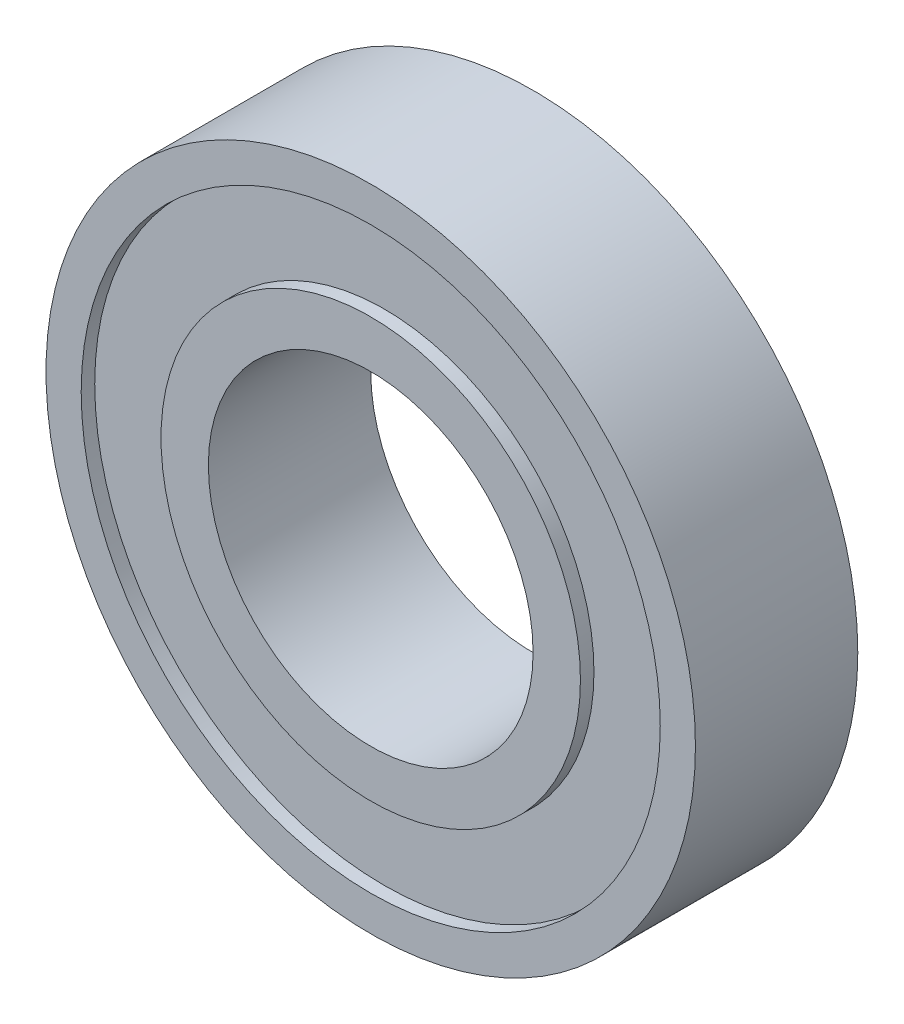
ISO-10303-21;
HEADER;
FILE_DESCRIPTION(('STEP AP214'),'2;1');
FILE_NAME('part.step','',(''),(''),'','','');
FILE_SCHEMA(('AUTOMOTIVE_DESIGN { 1 0 10303 214 1 1 1 1 }'));
ENDSEC;
DATA;
#1=APPLICATION_CONTEXT('core data for automotive mechanical design processes');
#2=APPLICATION_PROTOCOL_DEFINITION('international standard','automotive_design',2000,#1);
#3=PRODUCT_CONTEXT('',#1,'mechanical');
#4=PRODUCT('Part','Part','',(#3));
#5=PRODUCT_RELATED_PRODUCT_CATEGORY('part','',(#4));
#6=PRODUCT_DEFINITION_FORMATION('','',#4);
#7=PRODUCT_DEFINITION_CONTEXT('part definition',#1,'design');
#8=PRODUCT_DEFINITION('design','',#6,#7);
#9=PRODUCT_DEFINITION_SHAPE('','',#8);
#10=(LENGTH_UNIT() NAMED_UNIT(*) SI_UNIT(.MILLI.,.METRE.));
#11=(NAMED_UNIT(*) PLANE_ANGLE_UNIT() SI_UNIT($,.RADIAN.));
#12=(NAMED_UNIT(*) SI_UNIT($,.STERADIAN.) SOLID_ANGLE_UNIT());
#13=UNCERTAINTY_MEASURE_WITH_UNIT(LENGTH_MEASURE(1.E-05),#10,'distance_accuracy_value','');
#14=(GEOMETRIC_REPRESENTATION_CONTEXT(3) GLOBAL_UNCERTAINTY_ASSIGNED_CONTEXT((#13)) GLOBAL_UNIT_ASSIGNED_CONTEXT((#10,
#11,#12)) REPRESENTATION_CONTEXT('',''));
#15=CARTESIAN_POINT('',(0.,0.,0.));
#16=DIRECTION('',(0.,0.,1.));
#17=DIRECTION('',(1.,0.,0.));
#18=AXIS2_PLACEMENT_3D('',#15,#16,#17);
#19=CARTESIAN_POINT('',(0.,0.,-3.));
#20=DIRECTION('',(0.,0.,1.));
#21=DIRECTION('',(1.,0.,0.));
#22=AXIS2_PLACEMENT_3D('',#19,#20,#21);
#23=PLANE('',#22);
#24=CARTESIAN_POINT('',(0.,0.,-3.));
#25=DIRECTION('',(0.,0.,1.));
#26=DIRECTION('',(1.,0.,0.));
#27=AXIS2_PLACEMENT_3D('',#24,#25,#26);
#28=CIRCLE('',#27,6.);
#29=CARTESIAN_POINT('',(6.,0.,-3.));
#30=VERTEX_POINT('',#29);
#31=EDGE_CURVE('E41',#30,#30,#28,.T.);
#32=ORIENTED_EDGE('',*,*,#31,.T.);
#33=EDGE_LOOP('',(#32));
#34=FACE_BOUND('',#33,.T.);
#35=CARTESIAN_POINT('',(0.,0.,-3.));
#36=DIRECTION('',(0.,0.,1.));
#37=DIRECTION('',(1.,0.,0.));
#38=AXIS2_PLACEMENT_3D('',#35,#36,#37);
#39=CIRCLE('',#38,7.75);
#40=CARTESIAN_POINT('',(7.75,0.,-3.));
#41=VERTEX_POINT('',#40);
#42=EDGE_CURVE('E67',#41,#41,#39,.T.);
#43=ORIENTED_EDGE('',*,*,#42,.F.);
#44=EDGE_LOOP('',(#43));
#45=FACE_BOUND('',#44,.T.);
#46=ADVANCED_FACE('F30',(#34,#45),#23,.F.);
#47=CARTESIAN_POINT('',(0.,0.,3.));
#48=DIRECTION('',(0.,0.,1.));
#49=DIRECTION('',(1.,0.,0.));
#50=AXIS2_PLACEMENT_3D('',#47,#48,#49);
#51=PLANE('',#50);
#52=CARTESIAN_POINT('',(0.,0.,3.));
#53=DIRECTION('',(0.,0.,1.));
#54=DIRECTION('',(1.,0.,0.));
#55=AXIS2_PLACEMENT_3D('',#52,#53,#54);
#56=CIRCLE('',#55,6.);
#57=CARTESIAN_POINT('',(6.,0.,3.));
#58=VERTEX_POINT('',#57);
#59=EDGE_CURVE('E43',#58,#58,#56,.T.);
#60=ORIENTED_EDGE('',*,*,#59,.F.);
#61=EDGE_LOOP('',(#60));
#62=FACE_BOUND('',#61,.T.);
#63=CARTESIAN_POINT('',(0.,0.,3.));
#64=DIRECTION('',(0.,0.,1.));
#65=DIRECTION('',(1.,0.,0.));
#66=AXIS2_PLACEMENT_3D('',#63,#64,#65);
#67=CIRCLE('',#66,7.75);
#68=CARTESIAN_POINT('',(7.75,0.,3.));
#69=VERTEX_POINT('',#68);
#70=EDGE_CURVE('E55',#69,#69,#67,.T.);
#71=ORIENTED_EDGE('',*,*,#70,.T.);
#72=EDGE_LOOP('',(#71));
#73=FACE_BOUND('',#72,.T.);
#74=ADVANCED_FACE('F83',(#62,#73),#51,.T.);
#75=CARTESIAN_POINT('',(0.,0.,3.));
#76=DIRECTION('',(0.,0.,-1.));
#77=DIRECTION('',(-1.,0.,0.));
#78=AXIS2_PLACEMENT_3D('',#75,#76,#77);
#79=CYLINDRICAL_SURFACE('',#78,12.);
#80=CARTESIAN_POINT('',(0.,0.,3.));
#81=DIRECTION('',(0.,0.,1.));
#82=DIRECTION('',(1.,0.,0.));
#83=AXIS2_PLACEMENT_3D('',#80,#81,#82);
#84=CIRCLE('',#83,12.);
#85=CARTESIAN_POINT('',(12.,0.,3.));
#86=VERTEX_POINT('',#85);
#87=EDGE_CURVE('E10',#86,#86,#84,.T.);
#88=ORIENTED_EDGE('',*,*,#87,.F.);
#89=EDGE_LOOP('',(#88));
#90=FACE_BOUND('',#89,.T.);
#91=CARTESIAN_POINT('',(0.,0.,-3.));
#92=DIRECTION('',(0.,0.,1.));
#93=DIRECTION('',(1.,0.,0.));
#94=AXIS2_PLACEMENT_3D('',#91,#92,#93);
#95=CIRCLE('',#94,12.);
#96=CARTESIAN_POINT('',(12.,0.,-3.));
#97=VERTEX_POINT('',#96);
#98=EDGE_CURVE('E34',#97,#97,#95,.T.);
#99=ORIENTED_EDGE('',*,*,#98,.T.);
#100=EDGE_LOOP('',(#99));
#101=FACE_BOUND('',#100,.T.);
#102=ADVANCED_FACE('F32',(#90,#101),#79,.T.);
#103=CARTESIAN_POINT('',(0.,0.,3.));
#104=DIRECTION('',(0.,0.,1.));
#105=DIRECTION('',(1.,0.,0.));
#106=AXIS2_PLACEMENT_3D('',#103,#104,#105);
#107=CIRCLE('',#106,10.7);
#108=CARTESIAN_POINT('',(10.7,0.,3.));
#109=VERTEX_POINT('',#108);
#110=EDGE_CURVE('E49',#109,#109,#107,.T.);
#111=ORIENTED_EDGE('',*,*,#110,.F.);
#112=EDGE_LOOP('',(#111));
#113=FACE_BOUND('',#112,.T.);
#114=ORIENTED_EDGE('',*,*,#87,.T.);
#115=EDGE_LOOP('',(#114));
#116=FACE_BOUND('',#115,.T.);
#117=ADVANCED_FACE('F91',(#113,#116),#51,.T.);
#118=CARTESIAN_POINT('',(0.,0.,-3.));
#119=DIRECTION('',(0.,0.,1.));
#120=DIRECTION('',(1.,0.,0.));
#121=AXIS2_PLACEMENT_3D('',#118,#119,#120);
#122=CIRCLE('',#121,10.7);
#123=CARTESIAN_POINT('',(10.7,0.,-3.));
#124=VERTEX_POINT('',#123);
#125=EDGE_CURVE('E61',#124,#124,#122,.T.);
#126=ORIENTED_EDGE('',*,*,#125,.T.);
#127=EDGE_LOOP('',(#126));
#128=FACE_BOUND('',#127,.T.);
#129=ORIENTED_EDGE('',*,*,#98,.F.);
#130=EDGE_LOOP('',(#129));
#131=FACE_BOUND('',#130,.T.);
#132=ADVANCED_FACE('F85',(#128,#131),#23,.F.);
#133=CARTESIAN_POINT('',(0.,0.,-3.));
#134=DIRECTION('',(0.,0.,1.));
#135=DIRECTION('',(1.,0.,0.));
#136=AXIS2_PLACEMENT_3D('',#133,#134,#135);
#137=CYLINDRICAL_SURFACE('',#136,6.);
#138=ORIENTED_EDGE('',*,*,#31,.F.);
#139=EDGE_LOOP('',(#138));
#140=FACE_BOUND('',#139,.T.);
#141=ORIENTED_EDGE('',*,*,#59,.T.);
#142=EDGE_LOOP('',(#141));
#143=FACE_BOUND('',#142,.T.);
#144=ADVANCED_FACE('F93',(#140,#143),#137,.F.);
#145=CARTESIAN_POINT('',(0.,0.,2.5));
#146=DIRECTION('',(0.,0.,1.));
#147=DIRECTION('',(1.,0.,0.));
#148=AXIS2_PLACEMENT_3D('',#145,#146,#147);
#149=CYLINDRICAL_SURFACE('',#148,10.7);
#150=CARTESIAN_POINT('',(0.,0.,2.5));
#151=DIRECTION('',(0.,0.,1.));
#152=DIRECTION('',(1.,0.,0.));
#153=AXIS2_PLACEMENT_3D('',#150,#151,#152);
#154=CIRCLE('',#153,10.7);
#155=CARTESIAN_POINT('',(10.7,0.,2.5));
#156=VERTEX_POINT('',#155);
#157=EDGE_CURVE('E46',#156,#156,#154,.T.);
#158=ORIENTED_EDGE('',*,*,#157,.F.);
#159=EDGE_LOOP('',(#158));
#160=FACE_BOUND('',#159,.T.);
#161=ORIENTED_EDGE('',*,*,#110,.T.);
#162=EDGE_LOOP('',(#161));
#163=FACE_BOUND('',#162,.T.);
#164=ADVANCED_FACE('F99',(#160,#163),#149,.F.);
#165=CARTESIAN_POINT('',(0.,0.,2.5));
#166=DIRECTION('',(0.,0.,1.));
#167=DIRECTION('',(1.,0.,0.));
#168=AXIS2_PLACEMENT_3D('',#165,#166,#167);
#169=PLANE('',#168);
#170=CARTESIAN_POINT('',(0.,0.,2.5));
#171=DIRECTION('',(0.,0.,1.));
#172=DIRECTION('',(1.,0.,0.));
#173=AXIS2_PLACEMENT_3D('',#170,#171,#172);
#174=CIRCLE('',#173,7.75);
#175=CARTESIAN_POINT('',(7.75,0.,2.5));
#176=VERTEX_POINT('',#175);
#177=EDGE_CURVE('E52',#176,#176,#174,.T.);
#178=ORIENTED_EDGE('',*,*,#177,.F.);
#179=EDGE_LOOP('',(#178));
#180=FACE_BOUND('',#179,.T.);
#181=ORIENTED_EDGE('',*,*,#157,.T.);
#182=EDGE_LOOP('',(#181));
#183=FACE_BOUND('',#182,.T.);
#184=ADVANCED_FACE('F130',(#180,#183),#169,.T.);
#185=CARTESIAN_POINT('',(0.,0.,2.5));
#186=DIRECTION('',(0.,0.,1.));
#187=DIRECTION('',(1.,0.,0.));
#188=AXIS2_PLACEMENT_3D('',#185,#186,#187);
#189=CYLINDRICAL_SURFACE('',#188,7.75);
#190=ORIENTED_EDGE('',*,*,#177,.T.);
#191=EDGE_LOOP('',(#190));
#192=FACE_BOUND('',#191,.T.);
#193=ORIENTED_EDGE('',*,*,#70,.F.);
#194=EDGE_LOOP('',(#193));
#195=FACE_BOUND('',#194,.T.);
#196=ADVANCED_FACE('F140',(#192,#195),#189,.T.);
#197=CARTESIAN_POINT('',(0.,0.,-2.5));
#198=DIRECTION('',(0.,0.,-1.));
#199=DIRECTION('',(1.,0.,0.));
#200=AXIS2_PLACEMENT_3D('',#197,#198,#199);
#201=PLANE('',#200);
#202=CARTESIAN_POINT('',(0.,0.,-2.5));
#203=DIRECTION('',(0.,0.,1.));
#204=DIRECTION('',(1.,0.,0.));
#205=AXIS2_PLACEMENT_3D('',#202,#203,#204);
#206=CIRCLE('',#205,10.7);
#207=CARTESIAN_POINT('',(10.7,0.,-2.5));
#208=VERTEX_POINT('',#207);
#209=EDGE_CURVE('E58',#208,#208,#206,.T.);
#210=ORIENTED_EDGE('',*,*,#209,.F.);
#211=EDGE_LOOP('',(#210));
#212=FACE_BOUND('',#211,.T.);
#213=CARTESIAN_POINT('',(0.,0.,-2.5));
#214=DIRECTION('',(0.,0.,1.));
#215=DIRECTION('',(1.,0.,0.));
#216=AXIS2_PLACEMENT_3D('',#213,#214,#215);
#217=CIRCLE('',#216,7.75);
#218=CARTESIAN_POINT('',(7.75,0.,-2.5));
#219=VERTEX_POINT('',#218);
#220=EDGE_CURVE('E64',#219,#219,#217,.T.);
#221=ORIENTED_EDGE('',*,*,#220,.T.);
#222=EDGE_LOOP('',(#221));
#223=FACE_BOUND('',#222,.T.);
#224=ADVANCED_FACE('F73',(#212,#223),#201,.T.);
#225=CARTESIAN_POINT('',(0.,0.,-2.5));
#226=DIRECTION('',(0.,0.,-1.));
#227=DIRECTION('',(-1.,0.,0.));
#228=AXIS2_PLACEMENT_3D('',#225,#226,#227);
#229=CYLINDRICAL_SURFACE('',#228,10.7);
#230=ORIENTED_EDGE('',*,*,#209,.T.);
#231=EDGE_LOOP('',(#230));
#232=FACE_BOUND('',#231,.T.);
#233=ORIENTED_EDGE('',*,*,#125,.F.);
#234=EDGE_LOOP('',(#233));
#235=FACE_BOUND('',#234,.T.);
#236=ADVANCED_FACE('F78',(#232,#235),#229,.F.);
#237=CARTESIAN_POINT('',(0.,0.,-2.5));
#238=DIRECTION('',(0.,0.,-1.));
#239=DIRECTION('',(-1.,0.,0.));
#240=AXIS2_PLACEMENT_3D('',#237,#238,#239);
#241=CYLINDRICAL_SURFACE('',#240,7.75);
#242=ORIENTED_EDGE('',*,*,#220,.F.);
#243=EDGE_LOOP('',(#242));
#244=FACE_BOUND('',#243,.T.);
#245=ORIENTED_EDGE('',*,*,#42,.T.);
#246=EDGE_LOOP('',(#245));
#247=FACE_BOUND('',#246,.T.);
#248=ADVANCED_FACE('F75',(#244,#247),#241,.T.);
#249=CLOSED_SHELL('',(#46,#74,#102,#117,#132,#144,#164,#184,#196,#224,#236,#248));
#250=MANIFOLD_SOLID_BREP('B2',#249);
#251=ADVANCED_BREP_SHAPE_REPRESENTATION('',(#18,#250),#14);
#252=SHAPE_DEFINITION_REPRESENTATION(#9,#251);
ENDSEC;
END-ISO-10303-21;
